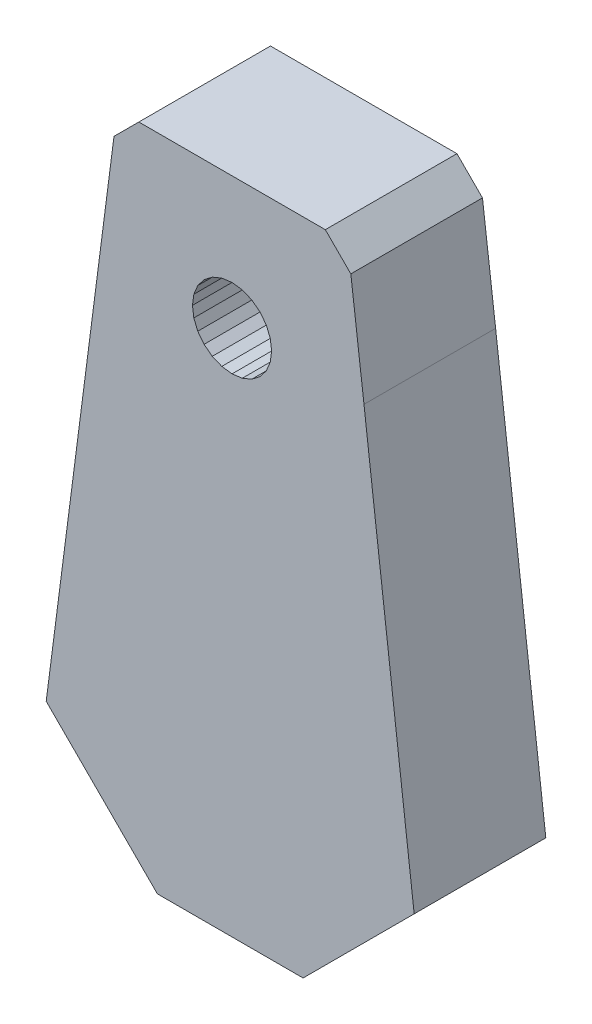
ISO-10303-21;
HEADER;
FILE_DESCRIPTION(('STEP AP214'),'2;1');
FILE_NAME('part.step','',(''),(''),'','','');
FILE_SCHEMA(('AUTOMOTIVE_DESIGN { 1 0 10303 214 1 1 1 1 }'));
ENDSEC;
DATA;
#1=APPLICATION_CONTEXT('core data for automotive mechanical design processes');
#2=APPLICATION_PROTOCOL_DEFINITION('international standard','automotive_design',2000,#1);
#3=PRODUCT_CONTEXT('',#1,'mechanical');
#4=PRODUCT('Part','Part','',(#3));
#5=PRODUCT_RELATED_PRODUCT_CATEGORY('part','',(#4));
#6=PRODUCT_DEFINITION_FORMATION('','',#4);
#7=PRODUCT_DEFINITION_CONTEXT('part definition',#1,'design');
#8=PRODUCT_DEFINITION('design','',#6,#7);
#9=PRODUCT_DEFINITION_SHAPE('','',#8);
#10=(LENGTH_UNIT() NAMED_UNIT(*) SI_UNIT(.MILLI.,.METRE.));
#11=(NAMED_UNIT(*) PLANE_ANGLE_UNIT() SI_UNIT($,.RADIAN.));
#12=(NAMED_UNIT(*) SI_UNIT($,.STERADIAN.) SOLID_ANGLE_UNIT());
#13=UNCERTAINTY_MEASURE_WITH_UNIT(LENGTH_MEASURE(1.E-05),#10,'distance_accuracy_value','');
#14=(GEOMETRIC_REPRESENTATION_CONTEXT(3) GLOBAL_UNCERTAINTY_ASSIGNED_CONTEXT((#13)) GLOBAL_UNIT_ASSIGNED_CONTEXT((#10,
#11,#12)) REPRESENTATION_CONTEXT('',''));
#15=CARTESIAN_POINT('',(0.,0.,0.));
#16=DIRECTION('',(0.,0.,1.));
#17=DIRECTION('',(1.,0.,0.));
#18=AXIS2_PLACEMENT_3D('',#15,#16,#17);
#19=CARTESIAN_POINT('',(-6.75209279180317,16.3009939923637,6.));
#20=DIRECTION('',(0.382683432365274,-0.923879532511211,0.));
#21=DIRECTION('',(0.923879532511211,0.382683432365274,0.));
#22=AXIS2_PLACEMENT_3D('',#19,#20,#21);
#23=PLANE('',#22);
#24=DIRECTION('',(-0.923879532511211,-0.382683432365274,0.));
#25=VECTOR('',#24,1.);
#26=CARTESIAN_POINT('',(-6.75209279180317,16.3009939923637,0.));
#27=LINE('',#26,#25);
#28=CARTESIAN_POINT('',(461.968382494161,210.451371817882,0.));
#29=VERTEX_POINT('',#28);
#30=CARTESIAN_POINT('',(461.53328192585,210.271147261492,0.));
#31=VERTEX_POINT('',#30);
#32=EDGE_CURVE('E305',#29,#31,#27,.T.);
#33=ORIENTED_EDGE('',*,*,#32,.T.);
#34=DIRECTION('',(0.,0.,-1.));
#35=VECTOR('',#34,1.);
#36=CARTESIAN_POINT('',(461.53328192585,210.271147261492,6.));
#37=LINE('',#36,#35);
#38=CARTESIAN_POINT('',(461.53328192585,210.271147261492,6.));
#39=VERTEX_POINT('',#38);
#40=EDGE_CURVE('E11',#39,#31,#37,.T.);
#41=ORIENTED_EDGE('',*,*,#40,.F.);
#42=DIRECTION('',(-0.923879532511211,-0.382683432365274,0.));
#43=VECTOR('',#42,1.);
#44=CARTESIAN_POINT('',(-6.75209279180317,16.3009939923637,6.));
#45=LINE('',#44,#43);
#46=CARTESIAN_POINT('',(461.968382494161,210.451371817882,6.));
#47=VERTEX_POINT('',#46);
#48=EDGE_CURVE('E490',#47,#39,#45,.T.);
#49=ORIENTED_EDGE('',*,*,#48,.F.);
#50=DIRECTION('',(0.,0.,-1.));
#51=VECTOR('',#50,1.);
#52=CARTESIAN_POINT('',(461.968382494161,210.451371817882,6.));
#53=LINE('',#52,#51);
#54=EDGE_CURVE('E352',#47,#29,#53,.T.);
#55=ORIENTED_EDGE('',*,*,#54,.T.);
#56=EDGE_LOOP('',(#33,#41,#49,#55));
#57=FACE_BOUND('',#56,.T.);
#58=ADVANCED_FACE('F32',(#57),#23,.F.);
#59=CARTESIAN_POINT('',(-19.3479061625486,146.961937806906,6.));
#60=DIRECTION('',(0.130526192219958,-0.991444861373823,0.));
#61=DIRECTION('',(0.991444861373823,0.130526192219958,0.));
#62=AXIS2_PLACEMENT_3D('',#59,#60,#61);
#63=PLANE('',#62);
#64=DIRECTION('',(-0.991444861373823,-0.130526192219958,0.));
#65=VECTOR('',#64,1.);
#66=CARTESIAN_POINT('',(-19.3479061625486,146.961937806906,0.));
#67=LINE('',#66,#65);
#68=CARTESIAN_POINT('',(461.066361502297,210.209676021557,0.));
#69=VERTEX_POINT('',#68);
#70=EDGE_CURVE('E308',#31,#69,#67,.T.);
#71=ORIENTED_EDGE('',*,*,#70,.T.);
#72=DIRECTION('',(0.,0.,-1.));
#73=VECTOR('',#72,1.);
#74=CARTESIAN_POINT('',(461.066361502297,210.209676021557,6.));
#75=LINE('',#74,#73);
#76=CARTESIAN_POINT('',(461.066361502297,210.209676021557,6.));
#77=VERTEX_POINT('',#76);
#78=EDGE_CURVE('E42',#77,#69,#75,.T.);
#79=ORIENTED_EDGE('',*,*,#78,.F.);
#80=DIRECTION('',(-0.991444861373823,-0.130526192219958,0.));
#81=VECTOR('',#80,1.);
#82=CARTESIAN_POINT('',(-19.3479061625486,146.961937806906,6.));
#83=LINE('',#82,#81);
#84=EDGE_CURVE('E492',#39,#77,#83,.T.);
#85=ORIENTED_EDGE('',*,*,#84,.F.);
#86=ORIENTED_EDGE('',*,*,#40,.T.);
#87=EDGE_LOOP('',(#71,#79,#85,#86));
#88=FACE_BOUND('',#87,.T.);
#89=ADVANCED_FACE('F557',(#88),#63,.F.);
#90=CARTESIAN_POINT('',(35.0583614566227,266.29469321974,6.));
#91=DIRECTION('',(-0.130526192219958,-0.991444861373823,0.));
#92=DIRECTION('',(0.991444861373823,-0.130526192219958,0.));
#93=AXIS2_PLACEMENT_3D('',#90,#91,#92);
#94=PLANE('',#93);
#95=DIRECTION('',(-0.991444861373823,0.130526192219958,0.));
#96=VECTOR('',#95,1.);
#97=CARTESIAN_POINT('',(35.0583614566227,266.29469321974,0.));
#98=LINE('',#97,#96);
#99=CARTESIAN_POINT('',(460.599441078744,210.271147261492,0.));
#100=VERTEX_POINT('',#99);
#101=EDGE_CURVE('E310',#69,#100,#98,.T.);
#102=ORIENTED_EDGE('',*,*,#101,.T.);
#103=DIRECTION('',(0.,0.,-1.));
#104=VECTOR('',#103,1.);
#105=CARTESIAN_POINT('',(460.599441078744,210.271147261492,6.));
#106=LINE('',#105,#104);
#107=CARTESIAN_POINT('',(460.599441078744,210.271147261492,6.));
#108=VERTEX_POINT('',#107);
#109=EDGE_CURVE('E407',#108,#100,#106,.T.);
#110=ORIENTED_EDGE('',*,*,#109,.F.);
#111=DIRECTION('',(-0.991444861373823,0.130526192219958,0.));
#112=VECTOR('',#111,1.);
#113=CARTESIAN_POINT('',(35.0583614566227,266.29469321974,6.));
#114=LINE('',#113,#112);
#115=EDGE_CURVE('E494',#77,#108,#114,.T.);
#116=ORIENTED_EDGE('',*,*,#115,.F.);
#117=ORIENTED_EDGE('',*,*,#78,.T.);
#118=EDGE_LOOP('',(#102,#110,#116,#117));
#119=FACE_BOUND('',#118,.T.);
#120=ADVANCED_FACE('F562',(#119),#94,.F.);
#121=CARTESIAN_POINT('',(141.795303499012,342.3241447878,6.));
#122=DIRECTION('',(-0.382683432365399,-0.923879532511159,0.));
#123=DIRECTION('',(0.923879532511159,-0.382683432365399,0.));
#124=AXIS2_PLACEMENT_3D('',#121,#122,#123);
#125=PLANE('',#124);
#126=DIRECTION('',(-0.923879532511159,0.382683432365399,0.));
#127=VECTOR('',#126,1.);
#128=CARTESIAN_POINT('',(141.795303499012,342.3241447878,0.));
#129=LINE('',#128,#127);
#130=CARTESIAN_POINT('',(460.164340510434,210.451371817882,0.));
#131=VERTEX_POINT('',#130);
#132=EDGE_CURVE('E312',#100,#131,#129,.T.);
#133=ORIENTED_EDGE('',*,*,#132,.T.);
#134=DIRECTION('',(0.,0.,-1.));
#135=VECTOR('',#134,1.);
#136=CARTESIAN_POINT('',(460.164340510434,210.451371817882,6.));
#137=LINE('',#136,#135);
#138=CARTESIAN_POINT('',(460.164340510434,210.451371817882,6.));
#139=VERTEX_POINT('',#138);
#140=EDGE_CURVE('E404',#139,#131,#137,.T.);
#141=ORIENTED_EDGE('',*,*,#140,.F.);
#142=DIRECTION('',(-0.923879532511159,0.382683432365399,0.));
#143=VECTOR('',#142,1.);
#144=CARTESIAN_POINT('',(141.795303499012,342.3241447878,6.));
#145=LINE('',#144,#143);
#146=EDGE_CURVE('E496',#108,#139,#145,.T.);
#147=ORIENTED_EDGE('',*,*,#146,.F.);
#148=ORIENTED_EDGE('',*,*,#109,.T.);
#149=EDGE_LOOP('',(#133,#141,#147,#148));
#150=FACE_BOUND('',#149,.T.);
#151=ADVANCED_FACE('F653',(#150),#125,.F.);
#152=CARTESIAN_POINT('',(272.172730263042,354.702407874309,6.));
#153=DIRECTION('',(-0.60876142900867,-0.793353340291274,0.));
#154=DIRECTION('',(0.793353340291274,-0.60876142900867,0.));
#155=AXIS2_PLACEMENT_3D('',#152,#153,#154);
#156=PLANE('',#155);
#157=DIRECTION('',(-0.793353340291274,0.60876142900867,0.));
#158=VECTOR('',#157,1.);
#159=CARTESIAN_POINT('',(272.172730263042,354.702407874309,0.));
#160=LINE('',#159,#158);
#161=CARTESIAN_POINT('',(459.790711182059,210.738067685045,0.));
#162=VERTEX_POINT('',#161);
#163=EDGE_CURVE('E314',#131,#162,#160,.T.);
#164=ORIENTED_EDGE('',*,*,#163,.T.);
#165=DIRECTION('',(0.,0.,-1.));
#166=VECTOR('',#165,1.);
#167=CARTESIAN_POINT('',(459.790711182059,210.738067685045,6.));
#168=LINE('',#167,#166);
#169=CARTESIAN_POINT('',(459.790711182059,210.738067685045,6.));
#170=VERTEX_POINT('',#169);
#171=EDGE_CURVE('E401',#170,#162,#168,.T.);
#172=ORIENTED_EDGE('',*,*,#171,.F.);
#173=DIRECTION('',(-0.793353340291274,0.60876142900867,0.));
#174=VECTOR('',#173,1.);
#175=CARTESIAN_POINT('',(272.172730263042,354.702407874309,6.));
#176=LINE('',#175,#174);
#177=EDGE_CURVE('E498',#139,#170,#176,.T.);
#178=ORIENTED_EDGE('',*,*,#177,.F.);
#179=ORIENTED_EDGE('',*,*,#140,.T.);
#180=EDGE_LOOP('',(#164,#172,#178,#179));
#181=FACE_BOUND('',#180,.T.);
#182=ADVANCED_FACE('F649',(#181),#156,.F.);
#183=CARTESIAN_POINT('',(391.175323078195,300.159382429334,6.));
#184=DIRECTION('',(-0.79335334029119,-0.608761429008779,0.));
#185=DIRECTION('',(0.608761429008779,-0.793353340291191,0.));
#186=AXIS2_PLACEMENT_3D('',#183,#184,#185);
#187=PLANE('',#186);
#188=DIRECTION('',(-0.608761429008779,0.793353340291191,0.));
#189=VECTOR('',#188,1.);
#190=CARTESIAN_POINT('',(391.175323078195,300.159382429334,0.));
#191=LINE('',#190,#189);
#192=CARTESIAN_POINT('',(459.504015314896,211.11169701342,0.));
#193=VERTEX_POINT('',#192);
#194=EDGE_CURVE('E316',#162,#193,#191,.T.);
#195=ORIENTED_EDGE('',*,*,#194,.T.);
#196=DIRECTION('',(0.,0.,-1.));
#197=VECTOR('',#196,1.);
#198=CARTESIAN_POINT('',(459.504015314896,211.11169701342,6.));
#199=LINE('',#198,#197);
#200=CARTESIAN_POINT('',(459.504015314896,211.11169701342,6.));
#201=VERTEX_POINT('',#200);
#202=EDGE_CURVE('E398',#201,#193,#199,.T.);
#203=ORIENTED_EDGE('',*,*,#202,.F.);
#204=DIRECTION('',(-0.608761429008779,0.793353340291191,0.));
#205=VECTOR('',#204,1.);
#206=CARTESIAN_POINT('',(391.175323078195,300.159382429334,6.));
#207=LINE('',#206,#205);
#208=EDGE_CURVE('E500',#170,#201,#207,.T.);
#209=ORIENTED_EDGE('',*,*,#208,.F.);
#210=ORIENTED_EDGE('',*,*,#171,.T.);
#211=EDGE_LOOP('',(#195,#203,#209,#210));
#212=FACE_BOUND('',#211,.T.);
#213=ADVANCED_FACE('F645',(#212),#187,.F.);
#214=CARTESIAN_POINT('',(466.850466536307,193.37579483936,6.));
#215=DIRECTION('',(-0.923879532511416,-0.382683432364778,0.));
#216=DIRECTION('',(0.382683432364778,-0.923879532511416,0.));
#217=AXIS2_PLACEMENT_3D('',#214,#215,#216);
#218=PLANE('',#217);
#219=DIRECTION('',(-0.382683432364778,0.923879532511416,0.));
#220=VECTOR('',#219,1.);
#221=CARTESIAN_POINT('',(466.850466536307,193.37579483936,0.));
#222=LINE('',#221,#220);
#223=CARTESIAN_POINT('',(459.323790758506,211.54679758173,0.));
#224=VERTEX_POINT('',#223);
#225=EDGE_CURVE('E318',#193,#224,#222,.T.);
#226=ORIENTED_EDGE('',*,*,#225,.T.);
#227=DIRECTION('',(0.,0.,-1.));
#228=VECTOR('',#227,1.);
#229=CARTESIAN_POINT('',(459.323790758506,211.54679758173,6.));
#230=LINE('',#229,#228);
#231=CARTESIAN_POINT('',(459.323790758506,211.54679758173,6.));
#232=VERTEX_POINT('',#231);
#233=EDGE_CURVE('E395',#232,#224,#230,.T.);
#234=ORIENTED_EDGE('',*,*,#233,.F.);
#235=DIRECTION('',(-0.382683432364778,0.923879532511416,0.));
#236=VECTOR('',#235,1.);
#237=CARTESIAN_POINT('',(466.850466536307,193.37579483936,6.));
#238=LINE('',#237,#236);
#239=EDGE_CURVE('E502',#201,#232,#238,.T.);
#240=ORIENTED_EDGE('',*,*,#239,.F.);
#241=ORIENTED_EDGE('',*,*,#202,.T.);
#242=EDGE_LOOP('',(#226,#234,#240,#241));
#243=FACE_BOUND('',#242,.T.);
#244=ADVANCED_FACE('F641',(#243),#218,.F.);
#245=CARTESIAN_POINT('',(478.874421512888,63.0450136229853,6.));
#246=DIRECTION('',(-0.991444861373785,-0.130526192220243,0.));
#247=DIRECTION('',(0.130526192220243,-0.991444861373785,0.));
#248=AXIS2_PLACEMENT_3D('',#245,#246,#247);
#249=PLANE('',#248);
#250=DIRECTION('',(-0.130526192220243,0.991444861373785,0.));
#251=VECTOR('',#250,1.);
#252=CARTESIAN_POINT('',(478.874421512888,63.0450136229853,0.));
#253=LINE('',#252,#251);
#254=CARTESIAN_POINT('',(459.262319518571,212.013718005283,0.));
#255=VERTEX_POINT('',#254);
#256=EDGE_CURVE('E320',#224,#255,#253,.T.);
#257=ORIENTED_EDGE('',*,*,#256,.T.);
#258=DIRECTION('',(0.,0.,-1.));
#259=VECTOR('',#258,1.);
#260=CARTESIAN_POINT('',(459.262319518571,212.013718005283,6.));
#261=LINE('',#260,#259);
#262=CARTESIAN_POINT('',(459.262319518571,212.013718005283,6.));
#263=VERTEX_POINT('',#262);
#264=EDGE_CURVE('E392',#263,#255,#261,.T.);
#265=ORIENTED_EDGE('',*,*,#264,.F.);
#266=DIRECTION('',(-0.130526192220243,0.991444861373785,0.));
#267=VECTOR('',#266,1.);
#268=CARTESIAN_POINT('',(478.874421512888,63.0450136229853,6.));
#269=LINE('',#268,#267);
#270=EDGE_CURVE('E504',#232,#263,#269,.T.);
#271=ORIENTED_EDGE('',*,*,#270,.F.);
#272=ORIENTED_EDGE('',*,*,#233,.T.);
#273=EDGE_LOOP('',(#257,#265,#271,#272));
#274=FACE_BOUND('',#273,.T.);
#275=ADVANCED_FACE('F637',(#274),#249,.F.);
#276=CARTESIAN_POINT('',(424.001233470089,-55.8208213665007,6.));
#277=DIRECTION('',(-0.991444861373802,0.130526192220114,0.));
#278=DIRECTION('',(-0.130526192220114,-0.991444861373802,0.));
#279=AXIS2_PLACEMENT_3D('',#276,#277,#278);
#280=PLANE('',#279);
#281=DIRECTION('',(0.130526192220114,0.991444861373802,0.));
#282=VECTOR('',#281,1.);
#283=CARTESIAN_POINT('',(424.001233470089,-55.8208213665007,0.));
#284=LINE('',#283,#282);
#285=CARTESIAN_POINT('',(459.323790758506,212.480638428836,0.));
#286=VERTEX_POINT('',#285);
#287=EDGE_CURVE('E322',#255,#286,#284,.T.);
#288=ORIENTED_EDGE('',*,*,#287,.T.);
#289=DIRECTION('',(0.,0.,-1.));
#290=VECTOR('',#289,1.);
#291=CARTESIAN_POINT('',(459.323790758506,212.480638428836,6.));
#292=LINE('',#291,#290);
#293=CARTESIAN_POINT('',(459.323790758506,212.480638428836,6.));
#294=VERTEX_POINT('',#293);
#295=EDGE_CURVE('E389',#294,#286,#292,.T.);
#296=ORIENTED_EDGE('',*,*,#295,.F.);
#297=DIRECTION('',(0.130526192220114,0.991444861373802,0.));
#298=VECTOR('',#297,1.);
#299=CARTESIAN_POINT('',(424.001233470089,-55.8208213665007,6.));
#300=LINE('',#299,#298);
#301=EDGE_CURVE('E506',#263,#294,#300,.T.);
#302=ORIENTED_EDGE('',*,*,#301,.F.);
#303=ORIENTED_EDGE('',*,*,#264,.T.);
#304=EDGE_LOOP('',(#288,#296,#302,#303));
#305=FACE_BOUND('',#304,.T.);
#306=ADVANCED_FACE('F633',(#305),#280,.F.);
#307=CARTESIAN_POINT('',(316.934128830343,-131.278414540271,6.));
#308=DIRECTION('',(-0.92387953251145,0.382683432364694,0.));
#309=DIRECTION('',(-0.382683432364695,-0.923879532511451,0.));
#310=AXIS2_PLACEMENT_3D('',#307,#308,#309);
#311=PLANE('',#310);
#312=DIRECTION('',(0.382683432364694,0.92387953251145,0.));
#313=VECTOR('',#312,1.);
#314=CARTESIAN_POINT('',(316.934128830343,-131.278414540271,0.));
#315=LINE('',#314,#313);
#316=CARTESIAN_POINT('',(459.504015314896,212.915738997146,0.));
#317=VERTEX_POINT('',#316);
#318=EDGE_CURVE('E324',#286,#317,#315,.T.);
#319=ORIENTED_EDGE('',*,*,#318,.T.);
#320=DIRECTION('',(0.,0.,-1.));
#321=VECTOR('',#320,1.);
#322=CARTESIAN_POINT('',(459.504015314896,212.915738997146,6.));
#323=LINE('',#322,#321);
#324=CARTESIAN_POINT('',(459.504015314896,212.915738997146,6.));
#325=VERTEX_POINT('',#324);
#326=EDGE_CURVE('E386',#325,#317,#323,.T.);
#327=ORIENTED_EDGE('',*,*,#326,.F.);
#328=DIRECTION('',(0.382683432364694,0.92387953251145,0.));
#329=VECTOR('',#328,1.);
#330=CARTESIAN_POINT('',(316.934128830343,-131.278414540271,6.));
#331=LINE('',#330,#329);
#332=EDGE_CURVE('E508',#294,#325,#331,.T.);
#333=ORIENTED_EDGE('',*,*,#332,.F.);
#334=ORIENTED_EDGE('',*,*,#295,.T.);
#335=EDGE_LOOP('',(#319,#327,#333,#334));
#336=FACE_BOUND('',#335,.T.);
#337=ADVANCED_FACE('F629',(#336),#311,.F.);
#338=CARTESIAN_POINT('',(186.385797329191,-143.018852466761,6.));
#339=DIRECTION('',(-0.793353340291037,0.608761429008978,0.));
#340=DIRECTION('',(-0.608761429008978,-0.793353340291038,0.));
#341=AXIS2_PLACEMENT_3D('',#338,#339,#340);
#342=PLANE('',#341);
#343=DIRECTION('',(0.608761429008978,0.793353340291038,0.));
#344=VECTOR('',#343,1.);
#345=CARTESIAN_POINT('',(186.385797329191,-143.018852466761,0.));
#346=LINE('',#345,#344);
#347=CARTESIAN_POINT('',(459.790711182059,213.289368325521,0.));
#348=VERTEX_POINT('',#347);
#349=EDGE_CURVE('E326',#317,#348,#346,.T.);
#350=ORIENTED_EDGE('',*,*,#349,.T.);
#351=DIRECTION('',(0.,0.,-1.));
#352=VECTOR('',#351,1.);
#353=CARTESIAN_POINT('',(459.790711182059,213.289368325521,6.));
#354=LINE('',#353,#352);
#355=CARTESIAN_POINT('',(459.790711182059,213.289368325521,6.));
#356=VERTEX_POINT('',#355);
#357=EDGE_CURVE('E383',#356,#348,#354,.T.);
#358=ORIENTED_EDGE('',*,*,#357,.F.);
#359=DIRECTION('',(0.608761429008978,0.793353340291038,0.));
#360=VECTOR('',#359,1.);
#361=CARTESIAN_POINT('',(186.385797329191,-143.018852466761,6.));
#362=LINE('',#361,#360);
#363=EDGE_CURVE('E510',#325,#356,#362,.T.);
#364=ORIENTED_EDGE('',*,*,#363,.F.);
#365=ORIENTED_EDGE('',*,*,#326,.T.);
#366=EDGE_LOOP('',(#350,#358,#364,#365));
#367=FACE_BOUND('',#366,.T.);
#368=ADVANCED_FACE('F625',(#367),#342,.F.);
#369=CARTESIAN_POINT('',(67.3832045140878,-87.8155018261614,6.));
#370=DIRECTION('',(-0.608761429008485,0.793353340291416,0.));
#371=DIRECTION('',(-0.793353340291416,-0.608761429008485,0.));
#372=AXIS2_PLACEMENT_3D('',#369,#370,#371);
#373=PLANE('',#372);
#374=DIRECTION('',(0.793353340291416,0.608761429008485,0.));
#375=VECTOR('',#374,1.);
#376=CARTESIAN_POINT('',(67.3832045140878,-87.8155018261614,0.));
#377=LINE('',#376,#375);
#378=CARTESIAN_POINT('',(460.164340510434,213.576064192684,0.));
#379=VERTEX_POINT('',#378);
#380=EDGE_CURVE('E328',#348,#379,#377,.T.);
#381=ORIENTED_EDGE('',*,*,#380,.T.);
#382=DIRECTION('',(0.,0.,-1.));
#383=VECTOR('',#382,1.);
#384=CARTESIAN_POINT('',(460.164340510434,213.576064192684,6.));
#385=LINE('',#384,#383);
#386=CARTESIAN_POINT('',(460.164340510434,213.576064192684,6.));
#387=VERTEX_POINT('',#386);
#388=EDGE_CURVE('E380',#387,#379,#385,.T.);
#389=ORIENTED_EDGE('',*,*,#388,.F.);
#390=DIRECTION('',(0.793353340291416,0.608761429008485,0.));
#391=VECTOR('',#390,1.);
#392=CARTESIAN_POINT('',(67.3832045140878,-87.8155018261614,6.));
#393=LINE('',#392,#391);
#394=EDGE_CURVE('E512',#356,#387,#393,.T.);
#395=ORIENTED_EDGE('',*,*,#394,.F.);
#396=ORIENTED_EDGE('',*,*,#357,.T.);
#397=EDGE_LOOP('',(#381,#389,#395,#396));
#398=FACE_BOUND('',#397,.T.);
#399=ADVANCED_FACE('F621',(#398),#373,.F.);
#400=CARTESIAN_POINT('',(-8.12103420726294,19.6059109236726,6.));
#401=DIRECTION('',(-0.382683432365046,0.923879532511305,0.));
#402=DIRECTION('',(-0.923879532511305,-0.382683432365047,0.));
#403=AXIS2_PLACEMENT_3D('',#400,#401,#402);
#404=PLANE('',#403);
#405=DIRECTION('',(0.923879532511305,0.382683432365047,0.));
#406=VECTOR('',#405,1.);
#407=CARTESIAN_POINT('',(-8.12103420726294,19.6059109236726,0.));
#408=LINE('',#407,#406);
#409=CARTESIAN_POINT('',(460.599441078744,213.756288749074,0.));
#410=VERTEX_POINT('',#409);
#411=EDGE_CURVE('E330',#379,#410,#408,.T.);
#412=ORIENTED_EDGE('',*,*,#411,.T.);
#413=DIRECTION('',(0.,0.,-1.));
#414=VECTOR('',#413,1.);
#415=CARTESIAN_POINT('',(460.599441078744,213.756288749074,6.));
#416=LINE('',#415,#414);
#417=CARTESIAN_POINT('',(460.599441078744,213.756288749074,6.));
#418=VERTEX_POINT('',#417);
#419=EDGE_CURVE('E377',#418,#410,#416,.T.);
#420=ORIENTED_EDGE('',*,*,#419,.F.);
#421=DIRECTION('',(0.923879532511305,0.382683432365047,0.));
#422=VECTOR('',#421,1.);
#423=CARTESIAN_POINT('',(-8.12103420726294,19.6059109236726,6.));
#424=LINE('',#423,#422);
#425=EDGE_CURVE('E514',#387,#418,#424,.T.);
#426=ORIENTED_EDGE('',*,*,#425,.F.);
#427=ORIENTED_EDGE('',*,*,#388,.T.);
#428=EDGE_LOOP('',(#412,#420,#426,#427));
#429=FACE_BOUND('',#428,.T.);
#430=ADVANCED_FACE('F617',(#429),#404,.F.);
#431=CARTESIAN_POINT('',(-19.8148265861267,150.508550534278,6.));
#432=DIRECTION('',(-0.130526192220248,0.991444861373785,0.));
#433=DIRECTION('',(-0.991444861373785,-0.130526192220248,0.));
#434=AXIS2_PLACEMENT_3D('',#431,#432,#433);
#435=PLANE('',#434);
#436=DIRECTION('',(0.991444861373785,0.130526192220248,0.));
#437=VECTOR('',#436,1.);
#438=CARTESIAN_POINT('',(-19.8148265861267,150.508550534278,0.));
#439=LINE('',#438,#437);
#440=CARTESIAN_POINT('',(461.066361502297,213.81775998901,0.));
#441=VERTEX_POINT('',#440);
#442=EDGE_CURVE('E332',#410,#441,#439,.T.);
#443=ORIENTED_EDGE('',*,*,#442,.T.);
#444=DIRECTION('',(0.,0.,-1.));
#445=VECTOR('',#444,1.);
#446=CARTESIAN_POINT('',(461.066361502297,213.81775998901,6.));
#447=LINE('',#446,#445);
#448=CARTESIAN_POINT('',(461.066361502297,213.81775998901,6.));
#449=VERTEX_POINT('',#448);
#450=EDGE_CURVE('E374',#449,#441,#447,.T.);
#451=ORIENTED_EDGE('',*,*,#450,.F.);
#452=DIRECTION('',(0.991444861373785,0.130526192220248,0.));
#453=VECTOR('',#452,1.);
#454=CARTESIAN_POINT('',(-19.8148265861267,150.508550534278,6.));
#455=LINE('',#454,#453);
#456=EDGE_CURVE('E516',#418,#449,#455,.T.);
#457=ORIENTED_EDGE('',*,*,#456,.F.);
#458=ORIENTED_EDGE('',*,*,#419,.T.);
#459=EDGE_LOOP('',(#443,#451,#457,#458));
#460=FACE_BOUND('',#459,.T.);
#461=ADVANCED_FACE('F613',(#460),#435,.F.);
#462=CARTESIAN_POINT('',(35.5252818802705,269.841305947372,6.));
#463=DIRECTION('',(0.130526192220248,0.991444861373785,0.));
#464=DIRECTION('',(-0.991444861373785,0.130526192220248,0.));
#465=AXIS2_PLACEMENT_3D('',#462,#463,#464);
#466=PLANE('',#465);
#467=DIRECTION('',(0.991444861373785,-0.130526192220248,0.));
#468=VECTOR('',#467,1.);
#469=CARTESIAN_POINT('',(35.5252818802705,269.841305947372,0.));
#470=LINE('',#469,#468);
#471=CARTESIAN_POINT('',(461.53328192585,213.756288749074,0.));
#472=VERTEX_POINT('',#471);
#473=EDGE_CURVE('E334',#441,#472,#470,.T.);
#474=ORIENTED_EDGE('',*,*,#473,.T.);
#475=DIRECTION('',(0.,0.,-1.));
#476=VECTOR('',#475,1.);
#477=CARTESIAN_POINT('',(461.53328192585,213.756288749074,6.));
#478=LINE('',#477,#476);
#479=CARTESIAN_POINT('',(461.53328192585,213.756288749074,6.));
#480=VERTEX_POINT('',#479);
#481=EDGE_CURVE('E371',#480,#472,#478,.T.);
#482=ORIENTED_EDGE('',*,*,#481,.F.);
#483=DIRECTION('',(0.991444861373785,-0.130526192220248,0.));
#484=VECTOR('',#483,1.);
#485=CARTESIAN_POINT('',(35.5252818802705,269.841305947372,6.));
#486=LINE('',#485,#484);
#487=EDGE_CURVE('E518',#449,#480,#486,.T.);
#488=ORIENTED_EDGE('',*,*,#487,.F.);
#489=ORIENTED_EDGE('',*,*,#450,.T.);
#490=EDGE_LOOP('',(#474,#482,#488,#489));
#491=FACE_BOUND('',#490,.T.);
#492=ADVANCED_FACE('F609',(#491),#466,.F.);
#493=CARTESIAN_POINT('',(143.164244914183,345.629061718901,6.));
#494=DIRECTION('',(0.382683432364922,0.923879532511357,0.));
#495=DIRECTION('',(-0.923879532511357,0.382683432364922,0.));
#496=AXIS2_PLACEMENT_3D('',#493,#494,#495);
#497=PLANE('',#496);
#498=DIRECTION('',(0.923879532511356,-0.382683432364921,0.));
#499=VECTOR('',#498,1.);
#500=CARTESIAN_POINT('',(143.164244914183,345.629061718901,0.));
#501=LINE('',#500,#499);
#502=CARTESIAN_POINT('',(461.968382494161,213.576064192684,0.));
#503=VERTEX_POINT('',#502);
#504=EDGE_CURVE('E336',#472,#503,#501,.T.);
#505=ORIENTED_EDGE('',*,*,#504,.T.);
#506=DIRECTION('',(0.,0.,-1.));
#507=VECTOR('',#506,1.);
#508=CARTESIAN_POINT('',(461.968382494161,213.576064192684,6.));
#509=LINE('',#508,#507);
#510=CARTESIAN_POINT('',(461.968382494161,213.576064192684,6.));
#511=VERTEX_POINT('',#510);
#512=EDGE_CURVE('E368',#511,#503,#509,.T.);
#513=ORIENTED_EDGE('',*,*,#512,.F.);
#514=DIRECTION('',(0.923879532511356,-0.382683432364921,0.));
#515=VECTOR('',#514,1.);
#516=CARTESIAN_POINT('',(143.164244914183,345.629061718901,6.));
#517=LINE('',#516,#515);
#518=EDGE_CURVE('E520',#480,#511,#517,.T.);
#519=ORIENTED_EDGE('',*,*,#518,.F.);
#520=ORIENTED_EDGE('',*,*,#481,.T.);
#521=EDGE_LOOP('',(#505,#513,#519,#520));
#522=FACE_BOUND('',#521,.T.);
#523=ADVANCED_FACE('F605',(#522),#497,.F.);
#524=CARTESIAN_POINT('',(274.350401575134,357.54040438195,6.));
#525=DIRECTION('',(0.608761429008655,0.793353340291285,0.));
#526=DIRECTION('',(-0.793353340291285,0.608761429008655,0.));
#527=AXIS2_PLACEMENT_3D('',#524,#525,#526);
#528=PLANE('',#527);
#529=DIRECTION('',(0.793353340291285,-0.608761429008655,0.));
#530=VECTOR('',#529,1.);
#531=CARTESIAN_POINT('',(274.350401575134,357.54040438195,0.));
#532=LINE('',#531,#530);
#533=CARTESIAN_POINT('',(462.342011822536,213.289368325521,0.));
#534=VERTEX_POINT('',#533);
#535=EDGE_CURVE('E338',#503,#534,#532,.T.);
#536=ORIENTED_EDGE('',*,*,#535,.T.);
#537=DIRECTION('',(0.,0.,-1.));
#538=VECTOR('',#537,1.);
#539=CARTESIAN_POINT('',(462.342011822536,213.289368325521,6.));
#540=LINE('',#539,#538);
#541=CARTESIAN_POINT('',(462.342011822536,213.289368325521,6.));
#542=VERTEX_POINT('',#541);
#543=EDGE_CURVE('E365',#542,#534,#540,.T.);
#544=ORIENTED_EDGE('',*,*,#543,.F.);
#545=DIRECTION('',(0.793353340291285,-0.608761429008655,0.));
#546=VECTOR('',#545,1.);
#547=CARTESIAN_POINT('',(274.350401575134,357.54040438195,6.));
#548=LINE('',#547,#546);
#549=EDGE_CURVE('E522',#511,#542,#548,.T.);
#550=ORIENTED_EDGE('',*,*,#549,.F.);
#551=ORIENTED_EDGE('',*,*,#512,.T.);
#552=EDGE_LOOP('',(#536,#544,#550,#551));
#553=FACE_BOUND('',#552,.T.);
#554=ADVANCED_FACE('F601',(#553),#528,.F.);
#555=CARTESIAN_POINT('',(394.013319585809,302.337053741456,6.));
#556=DIRECTION('',(0.793353340291151,0.60876142900883,0.));
#557=DIRECTION('',(-0.60876142900883,0.793353340291151,0.));
#558=AXIS2_PLACEMENT_3D('',#555,#556,#557);
#559=PLANE('',#558);
#560=DIRECTION('',(0.60876142900883,-0.793353340291151,0.));
#561=VECTOR('',#560,1.);
#562=CARTESIAN_POINT('',(394.013319585809,302.337053741456,0.));
#563=LINE('',#562,#561);
#564=CARTESIAN_POINT('',(462.628707689698,212.915738997146,0.));
#565=VERTEX_POINT('',#564);
#566=EDGE_CURVE('E340',#534,#565,#563,.T.);
#567=ORIENTED_EDGE('',*,*,#566,.T.);
#568=DIRECTION('',(0.,0.,-1.));
#569=VECTOR('',#568,1.);
#570=CARTESIAN_POINT('',(462.628707689698,212.915738997146,6.));
#571=LINE('',#570,#569);
#572=CARTESIAN_POINT('',(462.628707689698,212.915738997146,6.));
#573=VERTEX_POINT('',#572);
#574=EDGE_CURVE('E362',#573,#565,#571,.T.);
#575=ORIENTED_EDGE('',*,*,#574,.F.);
#576=DIRECTION('',(0.60876142900883,-0.793353340291151,0.));
#577=VECTOR('',#576,1.);
#578=CARTESIAN_POINT('',(394.013319585809,302.337053741456,6.));
#579=LINE('',#578,#577);
#580=EDGE_CURVE('E524',#542,#573,#579,.T.);
#581=ORIENTED_EDGE('',*,*,#580,.F.);
#582=ORIENTED_EDGE('',*,*,#543,.T.);
#583=EDGE_LOOP('',(#567,#575,#581,#582));
#584=FACE_BOUND('',#583,.T.);
#585=ADVANCED_FACE('F597',(#584),#559,.F.);
#586=CARTESIAN_POINT('',(470.155383467495,194.74473625479,6.));
#587=DIRECTION('',(0.923879532511405,0.382683432364805,0.));
#588=DIRECTION('',(-0.382683432364805,0.923879532511405,0.));
#589=AXIS2_PLACEMENT_3D('',#586,#587,#588);
#590=PLANE('',#589);
#591=DIRECTION('',(0.382683432364805,-0.923879532511405,0.));
#592=VECTOR('',#591,1.);
#593=CARTESIAN_POINT('',(470.155383467495,194.74473625479,0.));
#594=LINE('',#593,#592);
#595=CARTESIAN_POINT('',(462.808932246089,212.480638428836,0.));
#596=VERTEX_POINT('',#595);
#597=EDGE_CURVE('E342',#565,#596,#594,.T.);
#598=ORIENTED_EDGE('',*,*,#597,.T.);
#599=DIRECTION('',(0.,0.,-1.));
#600=VECTOR('',#599,1.);
#601=CARTESIAN_POINT('',(462.808932246089,212.480638428836,6.));
#602=LINE('',#601,#600);
#603=CARTESIAN_POINT('',(462.808932246089,212.480638428836,6.));
#604=VERTEX_POINT('',#603);
#605=EDGE_CURVE('E359',#604,#596,#602,.T.);
#606=ORIENTED_EDGE('',*,*,#605,.F.);
#607=DIRECTION('',(0.382683432364805,-0.923879532511405,0.));
#608=VECTOR('',#607,1.);
#609=CARTESIAN_POINT('',(470.155383467495,194.74473625479,6.));
#610=LINE('',#609,#608);
#611=EDGE_CURVE('E526',#573,#604,#610,.T.);
#612=ORIENTED_EDGE('',*,*,#611,.F.);
#613=ORIENTED_EDGE('',*,*,#574,.T.);
#614=EDGE_LOOP('',(#598,#606,#612,#613));
#615=FACE_BOUND('',#614,.T.);
#616=ADVANCED_FACE('F594',(#615),#590,.F.);
#617=CARTESIAN_POINT('',(482.421034240404,63.5119340465274,6.));
#618=DIRECTION('',(0.991444861373788,0.13052619222022,0.));
#619=DIRECTION('',(-0.13052619222022,0.991444861373788,0.));
#620=AXIS2_PLACEMENT_3D('',#617,#618,#619);
#621=PLANE('',#620);
#622=DIRECTION('',(0.13052619222022,-0.991444861373788,0.));
#623=VECTOR('',#622,1.);
#624=CARTESIAN_POINT('',(482.421034240404,63.5119340465274,0.));
#625=LINE('',#624,#623);
#626=CARTESIAN_POINT('',(462.870403486024,212.013718005283,0.));
#627=VERTEX_POINT('',#626);
#628=EDGE_CURVE('E344',#596,#627,#625,.T.);
#629=ORIENTED_EDGE('',*,*,#628,.T.);
#630=DIRECTION('',(0.,0.,-1.));
#631=VECTOR('',#630,1.);
#632=CARTESIAN_POINT('',(462.870403486024,212.013718005283,6.));
#633=LINE('',#632,#631);
#634=CARTESIAN_POINT('',(462.870403486024,212.013718005283,6.));
#635=VERTEX_POINT('',#634);
#636=EDGE_CURVE('E356',#635,#627,#633,.T.);
#637=ORIENTED_EDGE('',*,*,#636,.F.);
#638=DIRECTION('',(0.13052619222022,-0.991444861373788,0.));
#639=VECTOR('',#638,1.);
#640=CARTESIAN_POINT('',(482.421034240404,63.5119340465274,6.));
#641=LINE('',#640,#639);
#642=EDGE_CURVE('E528',#604,#635,#641,.T.);
#643=ORIENTED_EDGE('',*,*,#642,.F.);
#644=ORIENTED_EDGE('',*,*,#605,.T.);
#645=EDGE_LOOP('',(#629,#637,#643,#644));
#646=FACE_BOUND('',#645,.T.);
#647=ADVANCED_FACE('F534',(#646),#621,.F.);
#648=CARTESIAN_POINT('',(427.547846197564,-56.2877417901052,6.));
#649=DIRECTION('',(0.991444861373785,-0.130526192220243,0.));
#650=DIRECTION('',(0.130526192220243,0.991444861373785,0.));
#651=AXIS2_PLACEMENT_3D('',#648,#649,#650);
#652=PLANE('',#651);
#653=DIRECTION('',(-0.130526192220243,-0.991444861373785,0.));
#654=VECTOR('',#653,1.);
#655=CARTESIAN_POINT('',(427.547846197564,-56.2877417901052,0.));
#656=LINE('',#655,#654);
#657=CARTESIAN_POINT('',(462.808932246089,211.54679758173,0.));
#658=VERTEX_POINT('',#657);
#659=EDGE_CURVE('E346',#627,#658,#656,.T.);
#660=ORIENTED_EDGE('',*,*,#659,.T.);
#661=DIRECTION('',(0.,0.,-1.));
#662=VECTOR('',#661,1.);
#663=CARTESIAN_POINT('',(462.808932246089,211.54679758173,6.));
#664=LINE('',#663,#662);
#665=CARTESIAN_POINT('',(462.808932246089,211.54679758173,6.));
#666=VERTEX_POINT('',#665);
#667=EDGE_CURVE('E273',#666,#658,#664,.T.);
#668=ORIENTED_EDGE('',*,*,#667,.F.);
#669=DIRECTION('',(-0.130526192220243,-0.991444861373785,0.));
#670=VECTOR('',#669,1.);
#671=CARTESIAN_POINT('',(427.547846197564,-56.2877417901052,6.));
#672=LINE('',#671,#670);
#673=EDGE_CURVE('E264',#635,#666,#672,.T.);
#674=ORIENTED_EDGE('',*,*,#673,.F.);
#675=ORIENTED_EDGE('',*,*,#636,.T.);
#676=EDGE_LOOP('',(#660,#668,#674,#675));
#677=FACE_BOUND('',#676,.T.);
#678=ADVANCED_FACE('F538',(#677),#652,.F.);
#679=CARTESIAN_POINT('',(320.239045761404,-132.647355955735,6.));
#680=DIRECTION('',(0.923879532511344,-0.382683432364951,0.));
#681=DIRECTION('',(0.382683432364951,0.923879532511344,0.));
#682=AXIS2_PLACEMENT_3D('',#679,#680,#681);
#683=PLANE('',#682);
#684=DIRECTION('',(-0.382683432364951,-0.923879532511344,0.));
#685=VECTOR('',#684,1.);
#686=CARTESIAN_POINT('',(320.239045761404,-132.647355955735,0.));
#687=LINE('',#686,#685);
#688=CARTESIAN_POINT('',(462.628707689698,211.11169701342,0.));
#689=VERTEX_POINT('',#688);
#690=EDGE_CURVE('E272',#658,#689,#687,.T.);
#691=ORIENTED_EDGE('',*,*,#690,.T.);
#692=DIRECTION('',(0.,0.,-1.));
#693=VECTOR('',#692,1.);
#694=CARTESIAN_POINT('',(462.628707689698,211.11169701342,6.));
#695=LINE('',#694,#693);
#696=CARTESIAN_POINT('',(462.628707689698,211.11169701342,6.));
#697=VERTEX_POINT('',#696);
#698=EDGE_CURVE('E269',#697,#689,#695,.T.);
#699=ORIENTED_EDGE('',*,*,#698,.F.);
#700=DIRECTION('',(-0.382683432364951,-0.923879532511344,0.));
#701=VECTOR('',#700,1.);
#702=CARTESIAN_POINT('',(320.239045761404,-132.647355955735,6.));
#703=LINE('',#702,#701);
#704=EDGE_CURVE('E258',#666,#697,#703,.T.);
#705=ORIENTED_EDGE('',*,*,#704,.F.);
#706=ORIENTED_EDGE('',*,*,#667,.T.);
#707=EDGE_LOOP('',(#691,#699,#705,#706));
#708=FACE_BOUND('',#707,.T.);
#709=ADVANCED_FACE('F270',(#708),#683,.F.);
#710=CARTESIAN_POINT('',(189.223793836851,-145.196523778867,6.));
#711=DIRECTION('',(0.793353340291064,-0.608761429008944,0.));
#712=DIRECTION('',(0.608761429008944,0.793353340291064,0.));
#713=AXIS2_PLACEMENT_3D('',#710,#711,#712);
#714=PLANE('',#713);
#715=DIRECTION('',(-0.608761429008944,-0.793353340291064,0.));
#716=VECTOR('',#715,1.);
#717=CARTESIAN_POINT('',(189.223793836851,-145.196523778867,0.));
#718=LINE('',#717,#716);
#719=CARTESIAN_POINT('',(462.342011822536,210.738067685045,0.));
#720=VERTEX_POINT('',#719);
#721=EDGE_CURVE('E155',#689,#720,#718,.T.);
#722=ORIENTED_EDGE('',*,*,#721,.T.);
#723=DIRECTION('',(0.,0.,-1.));
#724=VECTOR('',#723,1.);
#725=CARTESIAN_POINT('',(462.342011822536,210.738067685045,6.));
#726=LINE('',#725,#724);
#727=CARTESIAN_POINT('',(462.342011822536,210.738067685045,6.));
#728=VERTEX_POINT('',#727);
#729=EDGE_CURVE('E274',#728,#720,#726,.T.);
#730=ORIENTED_EDGE('',*,*,#729,.F.);
#731=DIRECTION('',(-0.608761429008944,-0.793353340291064,0.));
#732=VECTOR('',#731,1.);
#733=CARTESIAN_POINT('',(189.223793836851,-145.196523778867,6.));
#734=LINE('',#733,#732);
#735=EDGE_CURVE('E262',#697,#728,#734,.T.);
#736=ORIENTED_EDGE('',*,*,#735,.F.);
#737=ORIENTED_EDGE('',*,*,#698,.T.);
#738=EDGE_LOOP('',(#722,#730,#736,#737));
#739=FACE_BOUND('',#738,.T.);
#740=ADVANCED_FACE('F276',(#739),#714,.F.);
#741=CARTESIAN_POINT('',(420.510231260339,-54.5016916213319,6.));
#742=DIRECTION('',(-0.991705180475739,0.128533400396871,0.));
#743=DIRECTION('',(-0.128533400396871,-0.991705180475739,0.));
#744=AXIS2_PLACEMENT_3D('',#741,#742,#743);
#745=PLANE('',#744);
#746=DIRECTION('',(0.128533400396871,0.991705180475739,0.));
#747=VECTOR('',#746,1.);
#748=CARTESIAN_POINT('',(420.510231260339,-54.5016916213319,0.));
#749=LINE('',#748,#747);
#750=CARTESIAN_POINT('',(452.594873350404,193.048794681695,0.));
#751=VERTEX_POINT('',#750);
#752=CARTESIAN_POINT('',(455.685560330902,216.895127855213,0.));
#753=VERTEX_POINT('',#752);
#754=EDGE_CURVE('E282',#751,#753,#749,.T.);
#755=ORIENTED_EDGE('',*,*,#754,.F.);
#756=DIRECTION('',(0.,0.,-1.));
#757=VECTOR('',#756,1.);
#758=CARTESIAN_POINT('',(452.594873350404,193.048794681695,6.));
#759=LINE('',#758,#757);
#760=CARTESIAN_POINT('',(452.594873350404,193.048794681695,6.));
#761=VERTEX_POINT('',#760);
#762=EDGE_CURVE('E36',#761,#751,#759,.T.);
#763=ORIENTED_EDGE('',*,*,#762,.F.);
#764=DIRECTION('',(0.128533400396871,0.991705180475739,0.));
#765=VECTOR('',#764,1.);
#766=CARTESIAN_POINT('',(420.510231260339,-54.5016916213319,6.));
#767=LINE('',#766,#765);
#768=CARTESIAN_POINT('',(455.685560330902,216.895127855213,6.));
#769=VERTEX_POINT('',#768);
#770=EDGE_CURVE('E351',#761,#769,#767,.T.);
#771=ORIENTED_EDGE('',*,*,#770,.T.);
#772=DIRECTION('',(0.,0.,-1.));
#773=VECTOR('',#772,1.);
#774=CARTESIAN_POINT('',(455.685560330902,216.895127855213,6.));
#775=LINE('',#774,#773);
#776=EDGE_CURVE('E278',#769,#753,#775,.T.);
#777=ORIENTED_EDGE('',*,*,#776,.T.);
#778=EDGE_LOOP('',(#755,#763,#771,#777));
#779=FACE_BOUND('',#778,.T.);
#780=ADVANCED_FACE('F34',(#779),#745,.T.);
#781=CARTESIAN_POINT('',(322.821834016068,322.821834016042,6.));
#782=DIRECTION('',(0.707106781186576,0.707106781186518,0.));
#783=DIRECTION('',(-0.707106781186518,0.707106781186576,0.));
#784=AXIS2_PLACEMENT_3D('',#781,#782,#783);
#785=PLANE('',#784);
#786=DIRECTION('',(0.707106781186518,-0.707106781186577,0.));
#787=VECTOR('',#786,1.);
#788=CARTESIAN_POINT('',(322.821834016068,322.821834016042,0.));
#789=LINE('',#788,#787);
#790=CARTESIAN_POINT('',(457.663031463049,187.98063656905,0.));
#791=VERTEX_POINT('',#790);
#792=EDGE_CURVE('E285',#751,#791,#789,.T.);
#793=ORIENTED_EDGE('',*,*,#792,.T.);
#794=DIRECTION('',(0.,0.,-1.));
#795=VECTOR('',#794,1.);
#796=CARTESIAN_POINT('',(457.663031463049,187.98063656905,6.));
#797=LINE('',#796,#795);
#798=CARTESIAN_POINT('',(457.663031463049,187.98063656905,6.));
#799=VERTEX_POINT('',#798);
#800=EDGE_CURVE('E427',#799,#791,#797,.T.);
#801=ORIENTED_EDGE('',*,*,#800,.F.);
#802=DIRECTION('',(0.707106781186518,-0.707106781186577,0.));
#803=VECTOR('',#802,1.);
#804=CARTESIAN_POINT('',(322.821834016068,322.821834016042,6.));
#805=LINE('',#804,#803);
#806=EDGE_CURVE('E436',#761,#799,#805,.T.);
#807=ORIENTED_EDGE('',*,*,#806,.F.);
#808=ORIENTED_EDGE('',*,*,#762,.T.);
#809=EDGE_LOOP('',(#793,#801,#807,#808));
#810=FACE_BOUND('',#809,.T.);
#811=ADVANCED_FACE('F435',(#810),#785,.F.);
#812=CARTESIAN_POINT('',(0.,187.98063656905,6.));
#813=DIRECTION('',(0.,1.,0.));
#814=DIRECTION('',(0.,0.,1.));
#815=AXIS2_PLACEMENT_3D('',#812,#813,#814);
#816=PLANE('',#815);
#817=DIRECTION('',(1.,0.,0.));
#818=VECTOR('',#817,1.);
#819=CARTESIAN_POINT('',(0.,187.98063656905,0.));
#820=LINE('',#819,#818);
#821=CARTESIAN_POINT('',(464.304980238708,187.98063656905,0.));
#822=VERTEX_POINT('',#821);
#823=EDGE_CURVE('E287',#791,#822,#820,.T.);
#824=ORIENTED_EDGE('',*,*,#823,.T.);
#825=DIRECTION('',(0.,0.,-1.));
#826=VECTOR('',#825,1.);
#827=CARTESIAN_POINT('',(464.304980238708,187.98063656905,6.));
#828=LINE('',#827,#826);
#829=CARTESIAN_POINT('',(464.304980238708,187.98063656905,6.));
#830=VERTEX_POINT('',#829);
#831=EDGE_CURVE('E425',#830,#822,#828,.T.);
#832=ORIENTED_EDGE('',*,*,#831,.F.);
#833=DIRECTION('',(1.,0.,0.));
#834=VECTOR('',#833,1.);
#835=CARTESIAN_POINT('',(0.,187.98063656905,6.));
#836=LINE('',#835,#834);
#837=EDGE_CURVE('E476',#799,#830,#836,.T.);
#838=ORIENTED_EDGE('',*,*,#837,.F.);
#839=ORIENTED_EDGE('',*,*,#800,.T.);
#840=EDGE_LOOP('',(#824,#832,#838,#839));
#841=FACE_BOUND('',#840,.T.);
#842=ADVANCED_FACE('F475',(#841),#816,.F.);
#843=CARTESIAN_POINT('',(138.162171834835,-138.162171834831,6.));
#844=DIRECTION('',(-0.707106781186557,0.707106781186538,0.));
#845=DIRECTION('',(-0.707106781186538,-0.707106781186557,0.));
#846=AXIS2_PLACEMENT_3D('',#843,#844,#845);
#847=PLANE('',#846);
#848=DIRECTION('',(0.707106781186538,0.707106781186557,0.));
#849=VECTOR('',#848,1.);
#850=CARTESIAN_POINT('',(138.162171834835,-138.162171834831,0.));
#851=LINE('',#850,#849);
#852=CARTESIAN_POINT('',(469.367845750652,193.043502080995,0.));
#853=VERTEX_POINT('',#852);
#854=EDGE_CURVE('E289',#822,#853,#851,.T.);
#855=ORIENTED_EDGE('',*,*,#854,.T.);
#856=DIRECTION('',(0.,0.,-1.));
#857=VECTOR('',#856,1.);
#858=CARTESIAN_POINT('',(469.367845750652,193.043502080995,6.));
#859=LINE('',#858,#857);
#860=CARTESIAN_POINT('',(469.367845750652,193.043502080995,6.));
#861=VERTEX_POINT('',#860);
#862=EDGE_CURVE('E422',#861,#853,#859,.T.);
#863=ORIENTED_EDGE('',*,*,#862,.F.);
#864=DIRECTION('',(0.707106781186538,0.707106781186557,0.));
#865=VECTOR('',#864,1.);
#866=CARTESIAN_POINT('',(138.162171834835,-138.162171834831,6.));
#867=LINE('',#866,#865);
#868=EDGE_CURVE('E473',#830,#861,#867,.T.);
#869=ORIENTED_EDGE('',*,*,#868,.F.);
#870=ORIENTED_EDGE('',*,*,#831,.T.);
#871=EDGE_LOOP('',(#855,#863,#869,#870));
#872=FACE_BOUND('',#871,.T.);
#873=ADVANCED_FACE('F472',(#872),#847,.F.);
#874=CARTESIAN_POINT('',(485.587149859691,58.5670047113744,6.));
#875=DIRECTION('',(-0.992804935017255,-0.119742895427592,0.));
#876=DIRECTION('',(0.119742895427592,-0.992804935017256,0.));
#877=AXIS2_PLACEMENT_3D('',#874,#875,#876);
#878=PLANE('',#877);
#879=DIRECTION('',(-0.119742895427592,0.992804935017256,0.));
#880=VECTOR('',#879,1.);
#881=CARTESIAN_POINT('',(485.587149859691,58.5670047113744,0.));
#882=LINE('',#881,#880);
#883=CARTESIAN_POINT('',(467.079834781386,212.013718005283,0.));
#884=VERTEX_POINT('',#883);
#885=EDGE_CURVE('E291',#853,#884,#882,.T.);
#886=ORIENTED_EDGE('',*,*,#885,.T.);
#887=DIRECTION('',(0.,0.,-1.));
#888=VECTOR('',#887,1.);
#889=CARTESIAN_POINT('',(467.079834781386,212.013718005283,6.));
#890=LINE('',#889,#888);
#891=CARTESIAN_POINT('',(467.079834781386,212.013718005283,6.));
#892=VERTEX_POINT('',#891);
#893=EDGE_CURVE('E419',#892,#884,#890,.T.);
#894=ORIENTED_EDGE('',*,*,#893,.F.);
#895=DIRECTION('',(-0.119742895427592,0.992804935017256,0.));
#896=VECTOR('',#895,1.);
#897=CARTESIAN_POINT('',(485.587149859691,58.5670047113744,6.));
#898=LINE('',#897,#896);
#899=EDGE_CURVE('E469',#861,#892,#898,.T.);
#900=ORIENTED_EDGE('',*,*,#899,.F.);
#901=ORIENTED_EDGE('',*,*,#862,.T.);
#902=EDGE_LOOP('',(#886,#894,#900,#901));
#903=FACE_BOUND('',#902,.T.);
#904=ADVANCED_FACE('F466',(#903),#878,.F.);
#905=CARTESIAN_POINT('',(485.850321968973,59.9872228458611,6.));
#906=DIRECTION('',(-0.992463816853779,-0.122538044035429,0.));
#907=DIRECTION('',(0.122538044035429,-0.992463816853779,0.));
#908=AXIS2_PLACEMENT_3D('',#905,#906,#907);
#909=PLANE('',#908);
#910=DIRECTION('',(-0.122538044035429,0.992463816853779,0.));
#911=VECTOR('',#910,1.);
#912=CARTESIAN_POINT('',(485.850321968973,59.9872228458611,0.));
#913=LINE('',#912,#911);
#914=CARTESIAN_POINT('',(466.481000515262,216.86381452917,0.));
#915=VERTEX_POINT('',#914);
#916=EDGE_CURVE('E293',#884,#915,#913,.T.);
#917=ORIENTED_EDGE('',*,*,#916,.T.);
#918=DIRECTION('',(0.,0.,-1.));
#919=VECTOR('',#918,1.);
#920=CARTESIAN_POINT('',(466.481000515262,216.86381452917,6.));
#921=LINE('',#920,#919);
#922=CARTESIAN_POINT('',(466.481000515262,216.86381452917,6.));
#923=VERTEX_POINT('',#922);
#924=EDGE_CURVE('E417',#923,#915,#921,.T.);
#925=ORIENTED_EDGE('',*,*,#924,.F.);
#926=DIRECTION('',(-0.122538044035429,0.992463816853779,0.));
#927=VECTOR('',#926,1.);
#928=CARTESIAN_POINT('',(485.850321968973,59.9872228458611,6.));
#929=LINE('',#928,#927);
#930=EDGE_CURVE('E484',#892,#923,#929,.T.);
#931=ORIENTED_EDGE('',*,*,#930,.F.);
#932=ORIENTED_EDGE('',*,*,#893,.T.);
#933=EDGE_LOOP('',(#917,#925,#931,#932));
#934=FACE_BOUND('',#933,.T.);
#935=ADVANCED_FACE('F462',(#934),#909,.F.);
#936=CARTESIAN_POINT('',(341.672407522261,341.672407522195,6.));
#937=DIRECTION('',(0.707106781186615,0.70710678118648,0.));
#938=DIRECTION('',(-0.70710678118648,0.707106781186615,0.));
#939=AXIS2_PLACEMENT_3D('',#936,#937,#938);
#940=PLANE('',#939);
#941=DIRECTION('',(0.70710678118648,-0.707106781186615,0.));
#942=VECTOR('',#941,1.);
#943=CARTESIAN_POINT('',(341.672407522261,341.672407522195,0.));
#944=LINE('',#943,#942);
#945=CARTESIAN_POINT('',(465.317623760061,218.027191284371,0.));
#946=VERTEX_POINT('',#945);
#947=EDGE_CURVE('E296',#946,#915,#944,.T.);
#948=ORIENTED_EDGE('',*,*,#947,.F.);
#949=DIRECTION('',(0.,0.,-1.));
#950=VECTOR('',#949,1.);
#951=CARTESIAN_POINT('',(465.317623760061,218.027191284371,6.));
#952=LINE('',#951,#950);
#953=CARTESIAN_POINT('',(465.317623760061,218.027191284371,6.));
#954=VERTEX_POINT('',#953);
#955=EDGE_CURVE('E415',#954,#946,#952,.T.);
#956=ORIENTED_EDGE('',*,*,#955,.F.);
#957=DIRECTION('',(0.70710678118648,-0.707106781186615,0.));
#958=VECTOR('',#957,1.);
#959=CARTESIAN_POINT('',(341.672407522261,341.672407522195,6.));
#960=LINE('',#959,#958);
#961=EDGE_CURVE('E459',#954,#923,#960,.T.);
#962=ORIENTED_EDGE('',*,*,#961,.T.);
#963=ORIENTED_EDGE('',*,*,#924,.T.);
#964=EDGE_LOOP('',(#948,#956,#962,#963));
#965=FACE_BOUND('',#964,.T.);
#966=ADVANCED_FACE('F454',(#965),#940,.T.);
#967=CARTESIAN_POINT('',(0.,218.027191284371,6.));
#968=DIRECTION('',(0.,-1.,0.));
#969=DIRECTION('',(0.,0.,-1.));
#970=AXIS2_PLACEMENT_3D('',#967,#968,#969);
#971=PLANE('',#970);
#972=DIRECTION('',(-1.,0.,0.));
#973=VECTOR('',#972,1.);
#974=CARTESIAN_POINT('',(0.,218.027191284371,0.));
#975=LINE('',#974,#973);
#976=CARTESIAN_POINT('',(456.817623760061,218.027191284371,0.));
#977=VERTEX_POINT('',#976);
#978=EDGE_CURVE('E299',#946,#977,#975,.T.);
#979=ORIENTED_EDGE('',*,*,#978,.T.);
#980=DIRECTION('',(0.,0.,-1.));
#981=VECTOR('',#980,1.);
#982=CARTESIAN_POINT('',(456.817623760061,218.027191284371,6.));
#983=LINE('',#982,#981);
#984=CARTESIAN_POINT('',(456.817623760061,218.027191284371,6.));
#985=VERTEX_POINT('',#984);
#986=EDGE_CURVE('E413',#985,#977,#983,.T.);
#987=ORIENTED_EDGE('',*,*,#986,.F.);
#988=DIRECTION('',(-1.,0.,0.));
#989=VECTOR('',#988,1.);
#990=CARTESIAN_POINT('',(0.,218.027191284371,6.));
#991=LINE('',#990,#989);
#992=EDGE_CURVE('E487',#954,#985,#991,.T.);
#993=ORIENTED_EDGE('',*,*,#992,.F.);
#994=ORIENTED_EDGE('',*,*,#955,.T.);
#995=EDGE_LOOP('',(#979,#987,#993,#994));
#996=FACE_BOUND('',#995,.T.);
#997=ADVANCED_FACE('F552',(#996),#971,.F.);
#998=CARTESIAN_POINT('',(119.395216237822,-119.395216237834,6.));
#999=DIRECTION('',(-0.707106781186513,0.707106781186582,0.));
#1000=DIRECTION('',(-0.707106781186582,-0.707106781186513,0.));
#1001=AXIS2_PLACEMENT_3D('',#998,#999,#1000);
#1002=PLANE('',#1001);
#1003=DIRECTION('',(0.707106781186582,0.707106781186513,0.));
#1004=VECTOR('',#1003,1.);
#1005=CARTESIAN_POINT('',(119.395216237822,-119.395216237834,0.));
#1006=LINE('',#1005,#1004);
#1007=EDGE_CURVE('E302',#753,#977,#1006,.T.);
#1008=ORIENTED_EDGE('',*,*,#1007,.F.);
#1009=ORIENTED_EDGE('',*,*,#776,.F.);
#1010=DIRECTION('',(0.707106781186582,0.707106781186513,0.));
#1011=VECTOR('',#1010,1.);
#1012=CARTESIAN_POINT('',(119.395216237822,-119.395216237834,6.));
#1013=LINE('',#1012,#1011);
#1014=EDGE_CURVE('E447',#769,#985,#1013,.T.);
#1015=ORIENTED_EDGE('',*,*,#1014,.T.);
#1016=ORIENTED_EDGE('',*,*,#986,.T.);
#1017=EDGE_LOOP('',(#1008,#1009,#1015,#1016));
#1018=FACE_BOUND('',#1017,.T.);
#1019=ADVANCED_FACE('F446',(#1018),#1002,.T.);
#1020=CARTESIAN_POINT('',(69.5608758263645,-90.6534983339462,6.));
#1021=DIRECTION('',(0.608761429008841,-0.793353340291143,0.));
#1022=DIRECTION('',(0.793353340291143,0.608761429008841,0.));
#1023=AXIS2_PLACEMENT_3D('',#1020,#1021,#1022);
#1024=PLANE('',#1023);
#1025=DIRECTION('',(-0.793353340291143,-0.608761429008841,0.));
#1026=VECTOR('',#1025,1.);
#1027=CARTESIAN_POINT('',(69.5608758263645,-90.6534983339462,0.));
#1028=LINE('',#1027,#1026);
#1029=EDGE_CURVE('E161',#720,#29,#1028,.T.);
#1030=ORIENTED_EDGE('',*,*,#1029,.T.);
#1031=ORIENTED_EDGE('',*,*,#54,.F.);
#1032=DIRECTION('',(-0.793353340291143,-0.608761429008841,0.));
#1033=VECTOR('',#1032,1.);
#1034=CARTESIAN_POINT('',(69.5608758263645,-90.6534983339462,6.));
#1035=LINE('',#1034,#1033);
#1036=EDGE_CURVE('E51',#728,#47,#1035,.T.);
#1037=ORIENTED_EDGE('',*,*,#1036,.F.);
#1038=ORIENTED_EDGE('',*,*,#729,.T.);
#1039=EDGE_LOOP('',(#1030,#1031,#1037,#1038));
#1040=FACE_BOUND('',#1039,.T.);
#1041=ADVANCED_FACE('F544',(#1040),#1024,.F.);
#1042=CARTESIAN_POINT('',(0.,0.,6.));
#1043=DIRECTION('',(0.,0.,1.));
#1044=DIRECTION('',(1.,0.,0.));
#1045=AXIS2_PLACEMENT_3D('',#1042,#1043,#1044);
#1046=PLANE('',#1045);
#1047=ORIENTED_EDGE('',*,*,#770,.F.);
#1048=ORIENTED_EDGE('',*,*,#806,.T.);
#1049=ORIENTED_EDGE('',*,*,#837,.T.);
#1050=ORIENTED_EDGE('',*,*,#868,.T.);
#1051=ORIENTED_EDGE('',*,*,#899,.T.);
#1052=ORIENTED_EDGE('',*,*,#930,.T.);
#1053=ORIENTED_EDGE('',*,*,#961,.F.);
#1054=ORIENTED_EDGE('',*,*,#992,.T.);
#1055=ORIENTED_EDGE('',*,*,#1014,.F.);
#1056=EDGE_LOOP('',(#1047,#1048,#1049,#1050,#1051,#1052,#1053,#1054,#1055));
#1057=FACE_BOUND('',#1056,.T.);
#1058=ORIENTED_EDGE('',*,*,#48,.T.);
#1059=ORIENTED_EDGE('',*,*,#84,.T.);
#1060=ORIENTED_EDGE('',*,*,#115,.T.);
#1061=ORIENTED_EDGE('',*,*,#146,.T.);
#1062=ORIENTED_EDGE('',*,*,#177,.T.);
#1063=ORIENTED_EDGE('',*,*,#208,.T.);
#1064=ORIENTED_EDGE('',*,*,#239,.T.);
#1065=ORIENTED_EDGE('',*,*,#270,.T.);
#1066=ORIENTED_EDGE('',*,*,#301,.T.);
#1067=ORIENTED_EDGE('',*,*,#332,.T.);
#1068=ORIENTED_EDGE('',*,*,#363,.T.);
#1069=ORIENTED_EDGE('',*,*,#394,.T.);
#1070=ORIENTED_EDGE('',*,*,#425,.T.);
#1071=ORIENTED_EDGE('',*,*,#456,.T.);
#1072=ORIENTED_EDGE('',*,*,#487,.T.);
#1073=ORIENTED_EDGE('',*,*,#518,.T.);
#1074=ORIENTED_EDGE('',*,*,#549,.T.);
#1075=ORIENTED_EDGE('',*,*,#580,.T.);
#1076=ORIENTED_EDGE('',*,*,#611,.T.);
#1077=ORIENTED_EDGE('',*,*,#642,.T.);
#1078=ORIENTED_EDGE('',*,*,#673,.T.);
#1079=ORIENTED_EDGE('',*,*,#704,.T.);
#1080=ORIENTED_EDGE('',*,*,#735,.T.);
#1081=ORIENTED_EDGE('',*,*,#1036,.T.);
#1082=EDGE_LOOP('',(#1058,#1059,#1060,#1061,#1062,#1063,#1064,#1065,#1066,#1067,#1068,#1069,
#1070,#1071,#1072,#1073,#1074,#1075,#1076,#1077,#1078,#1079,#1080,#1081));
#1083=FACE_BOUND('',#1082,.T.);
#1084=ADVANCED_FACE('F260',(#1057,#1083),#1046,.T.);
#1085=CARTESIAN_POINT('',(0.,0.,0.));
#1086=DIRECTION('',(0.,0.,1.));
#1087=DIRECTION('',(1.,0.,0.));
#1088=AXIS2_PLACEMENT_3D('',#1085,#1086,#1087);
#1089=PLANE('',#1088);
#1090=ORIENTED_EDGE('',*,*,#754,.T.);
#1091=ORIENTED_EDGE('',*,*,#1007,.T.);
#1092=ORIENTED_EDGE('',*,*,#978,.F.);
#1093=ORIENTED_EDGE('',*,*,#947,.T.);
#1094=ORIENTED_EDGE('',*,*,#916,.F.);
#1095=ORIENTED_EDGE('',*,*,#885,.F.);
#1096=ORIENTED_EDGE('',*,*,#854,.F.);
#1097=ORIENTED_EDGE('',*,*,#823,.F.);
#1098=ORIENTED_EDGE('',*,*,#792,.F.);
#1099=EDGE_LOOP('',(#1090,#1091,#1092,#1093,#1094,#1095,#1096,#1097,#1098));
#1100=FACE_BOUND('',#1099,.T.);
#1101=ORIENTED_EDGE('',*,*,#32,.F.);
#1102=ORIENTED_EDGE('',*,*,#1029,.F.);
#1103=ORIENTED_EDGE('',*,*,#721,.F.);
#1104=ORIENTED_EDGE('',*,*,#690,.F.);
#1105=ORIENTED_EDGE('',*,*,#659,.F.);
#1106=ORIENTED_EDGE('',*,*,#628,.F.);
#1107=ORIENTED_EDGE('',*,*,#597,.F.);
#1108=ORIENTED_EDGE('',*,*,#566,.F.);
#1109=ORIENTED_EDGE('',*,*,#535,.F.);
#1110=ORIENTED_EDGE('',*,*,#504,.F.);
#1111=ORIENTED_EDGE('',*,*,#473,.F.);
#1112=ORIENTED_EDGE('',*,*,#442,.F.);
#1113=ORIENTED_EDGE('',*,*,#411,.F.);
#1114=ORIENTED_EDGE('',*,*,#380,.F.);
#1115=ORIENTED_EDGE('',*,*,#349,.F.);
#1116=ORIENTED_EDGE('',*,*,#318,.F.);
#1117=ORIENTED_EDGE('',*,*,#287,.F.);
#1118=ORIENTED_EDGE('',*,*,#256,.F.);
#1119=ORIENTED_EDGE('',*,*,#225,.F.);
#1120=ORIENTED_EDGE('',*,*,#194,.F.);
#1121=ORIENTED_EDGE('',*,*,#163,.F.);
#1122=ORIENTED_EDGE('',*,*,#132,.F.);
#1123=ORIENTED_EDGE('',*,*,#101,.F.);
#1124=ORIENTED_EDGE('',*,*,#70,.F.);
#1125=EDGE_LOOP('',(#1101,#1102,#1103,#1104,#1105,#1106,#1107,#1108,#1109,#1110,#1111,#1112,
#1113,#1114,#1115,#1116,#1117,#1118,#1119,#1120,#1121,#1122,#1123,#1124));
#1126=FACE_BOUND('',#1125,.T.);
#1127=ADVANCED_FACE('F439',(#1100,#1126),#1089,.F.);
#1128=CLOSED_SHELL('',(#58,#89,#120,#151,#182,#213,#244,#275,#306,#337,#368,#399,#430,#461,#492,
#523,#554,#585,#616,#647,#678,#709,#740,#780,#811,#842,#873,#904,#935,#966,#997,#1019,#1041,
#1084,#1127));
#1129=MANIFOLD_SOLID_BREP('B2',#1128);
#1130=ADVANCED_BREP_SHAPE_REPRESENTATION('',(#18,#1129),#14);
#1131=SHAPE_DEFINITION_REPRESENTATION(#9,#1130);
ENDSEC;
END-ISO-10303-21;
